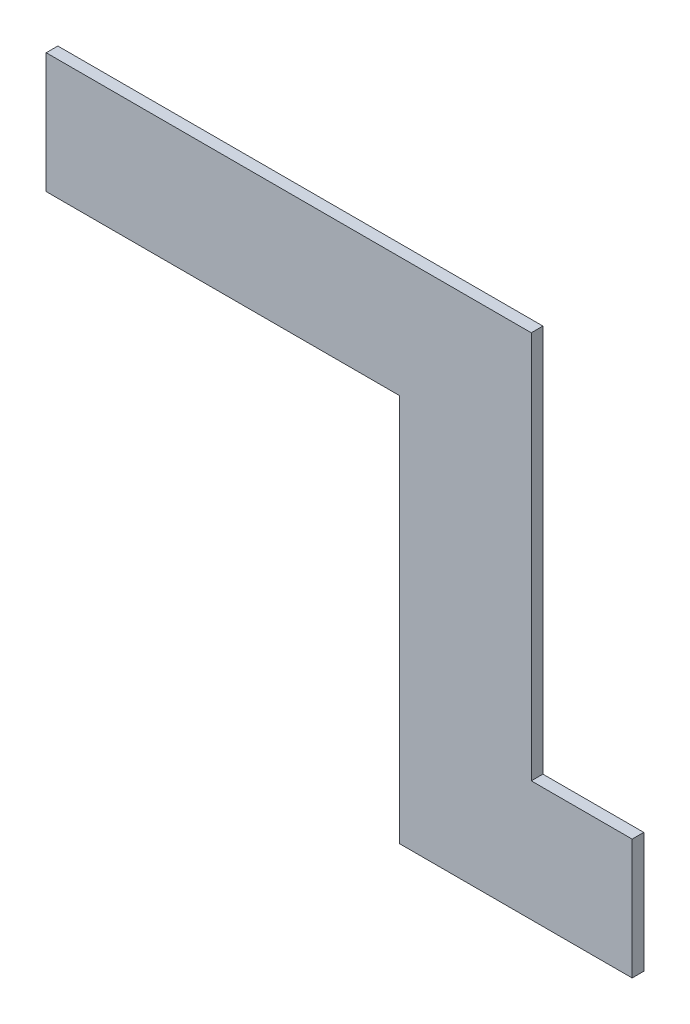
ISO-10303-21;
HEADER;
FILE_DESCRIPTION(('STEP AP214'),'2;1');
FILE_NAME('part.step','',(''),(''),'','','');
FILE_SCHEMA(('AUTOMOTIVE_DESIGN { 1 0 10303 214 1 1 1 1 }'));
ENDSEC;
DATA;
#1=APPLICATION_CONTEXT('core data for automotive mechanical design processes');
#2=APPLICATION_PROTOCOL_DEFINITION('international standard','automotive_design',2000,#1);
#3=PRODUCT_CONTEXT('',#1,'mechanical');
#4=PRODUCT('Part','Part','',(#3));
#5=PRODUCT_RELATED_PRODUCT_CATEGORY('part','',(#4));
#6=PRODUCT_DEFINITION_FORMATION('','',#4);
#7=PRODUCT_DEFINITION_CONTEXT('part definition',#1,'design');
#8=PRODUCT_DEFINITION('design','',#6,#7);
#9=PRODUCT_DEFINITION_SHAPE('','',#8);
#10=(LENGTH_UNIT() NAMED_UNIT(*) SI_UNIT(.MILLI.,.METRE.));
#11=(NAMED_UNIT(*) PLANE_ANGLE_UNIT() SI_UNIT($,.RADIAN.));
#12=(NAMED_UNIT(*) SI_UNIT($,.STERADIAN.) SOLID_ANGLE_UNIT());
#13=UNCERTAINTY_MEASURE_WITH_UNIT(LENGTH_MEASURE(1.E-05),#10,'distance_accuracy_value','');
#14=(GEOMETRIC_REPRESENTATION_CONTEXT(3) GLOBAL_UNCERTAINTY_ASSIGNED_CONTEXT((#13)) GLOBAL_UNIT_ASSIGNED_CONTEXT((#10,
#11,#12)) REPRESENTATION_CONTEXT('',''));
#15=CARTESIAN_POINT('',(0.,0.,0.));
#16=DIRECTION('',(0.,0.,1.));
#17=DIRECTION('',(1.,0.,0.));
#18=AXIS2_PLACEMENT_3D('',#15,#16,#17);
#19=CARTESIAN_POINT('',(34.,81.,3.));
#20=DIRECTION('',(0.,-1.,0.));
#21=DIRECTION('',(1.,0.,0.));
#22=AXIS2_PLACEMENT_3D('',#19,#20,#21);
#23=PLANE('',#22);
#24=DIRECTION('',(-1.,0.,0.));
#25=VECTOR('',#24,1.);
#26=CARTESIAN_POINT('',(34.,81.,0.));
#27=LINE('',#26,#25);
#28=CARTESIAN_POINT('',(34.,81.,0.));
#29=VERTEX_POINT('',#28);
#30=CARTESIAN_POINT('',(-91.,81.,0.));
#31=VERTEX_POINT('',#30);
#32=EDGE_CURVE('E129',#29,#31,#27,.T.);
#33=ORIENTED_EDGE('',*,*,#32,.T.);
#34=DIRECTION('',(0.,0.,-1.));
#35=VECTOR('',#34,1.);
#36=CARTESIAN_POINT('',(-91.,81.,3.));
#37=LINE('',#36,#35);
#38=CARTESIAN_POINT('',(-91.,81.,3.));
#39=VERTEX_POINT('',#38);
#40=EDGE_CURVE('E11',#39,#31,#37,.T.);
#41=ORIENTED_EDGE('',*,*,#40,.F.);
#42=DIRECTION('',(-1.,0.,0.));
#43=VECTOR('',#42,1.);
#44=CARTESIAN_POINT('',(34.,81.,3.));
#45=LINE('',#44,#43);
#46=CARTESIAN_POINT('',(34.,81.,3.));
#47=VERTEX_POINT('',#46);
#48=EDGE_CURVE('E143',#47,#39,#45,.T.);
#49=ORIENTED_EDGE('',*,*,#48,.F.);
#50=DIRECTION('',(0.,0.,-1.));
#51=VECTOR('',#50,1.);
#52=CARTESIAN_POINT('',(34.,81.,3.));
#53=LINE('',#52,#51);
#54=EDGE_CURVE('E125',#47,#29,#53,.T.);
#55=ORIENTED_EDGE('',*,*,#54,.T.);
#56=EDGE_LOOP('',(#33,#41,#49,#55));
#57=FACE_BOUND('',#56,.T.);
#58=ADVANCED_FACE('F33',(#57),#23,.F.);
#59=CARTESIAN_POINT('',(-91.,81.,3.));
#60=DIRECTION('',(1.,0.,0.));
#61=DIRECTION('',(0.,0.,-1.));
#62=AXIS2_PLACEMENT_3D('',#59,#60,#61);
#63=PLANE('',#62);
#64=DIRECTION('',(0.,-1.,0.));
#65=VECTOR('',#64,1.);
#66=CARTESIAN_POINT('',(-91.,81.,0.));
#67=LINE('',#66,#65);
#68=CARTESIAN_POINT('',(-91.,50.,0.));
#69=VERTEX_POINT('',#68);
#70=EDGE_CURVE('E132',#31,#69,#67,.T.);
#71=ORIENTED_EDGE('',*,*,#70,.T.);
#72=DIRECTION('',(0.,0.,-1.));
#73=VECTOR('',#72,1.);
#74=CARTESIAN_POINT('',(-91.,50.,3.));
#75=LINE('',#74,#73);
#76=CARTESIAN_POINT('',(-91.,50.,3.));
#77=VERTEX_POINT('',#76);
#78=EDGE_CURVE('E41',#77,#69,#75,.T.);
#79=ORIENTED_EDGE('',*,*,#78,.F.);
#80=DIRECTION('',(0.,-1.,0.));
#81=VECTOR('',#80,1.);
#82=CARTESIAN_POINT('',(-91.,81.,3.));
#83=LINE('',#82,#81);
#84=EDGE_CURVE('E92',#39,#77,#83,.T.);
#85=ORIENTED_EDGE('',*,*,#84,.F.);
#86=ORIENTED_EDGE('',*,*,#40,.T.);
#87=EDGE_LOOP('',(#71,#79,#85,#86));
#88=FACE_BOUND('',#87,.T.);
#89=ADVANCED_FACE('F178',(#88),#63,.F.);
#90=CARTESIAN_POINT('',(-91.,50.,3.));
#91=DIRECTION('',(0.,1.,0.));
#92=DIRECTION('',(0.,0.,1.));
#93=AXIS2_PLACEMENT_3D('',#90,#91,#92);
#94=PLANE('',#93);
#95=DIRECTION('',(1.,0.,0.));
#96=VECTOR('',#95,1.);
#97=CARTESIAN_POINT('',(-91.,50.,0.));
#98=LINE('',#97,#96);
#99=CARTESIAN_POINT('',(0.,50.,0.));
#100=VERTEX_POINT('',#99);
#101=EDGE_CURVE('E134',#69,#100,#98,.T.);
#102=ORIENTED_EDGE('',*,*,#101,.T.);
#103=DIRECTION('',(0.,0.,-1.));
#104=VECTOR('',#103,1.);
#105=CARTESIAN_POINT('',(0.,50.,3.));
#106=LINE('',#105,#104);
#107=CARTESIAN_POINT('',(0.,50.,3.));
#108=VERTEX_POINT('',#107);
#109=EDGE_CURVE('E150',#108,#100,#106,.T.);
#110=ORIENTED_EDGE('',*,*,#109,.F.);
#111=DIRECTION('',(1.,0.,0.));
#112=VECTOR('',#111,1.);
#113=CARTESIAN_POINT('',(-91.,50.,3.));
#114=LINE('',#113,#112);
#115=EDGE_CURVE('E158',#77,#108,#114,.T.);
#116=ORIENTED_EDGE('',*,*,#115,.F.);
#117=ORIENTED_EDGE('',*,*,#78,.T.);
#118=EDGE_LOOP('',(#102,#110,#116,#117));
#119=FACE_BOUND('',#118,.T.);
#120=ADVANCED_FACE('F156',(#119),#94,.F.);
#121=CARTESIAN_POINT('',(0.,50.,3.));
#122=DIRECTION('',(1.,0.,0.));
#123=DIRECTION('',(0.,0.,-1.));
#124=AXIS2_PLACEMENT_3D('',#121,#122,#123);
#125=PLANE('',#124);
#126=DIRECTION('',(0.,-1.,0.));
#127=VECTOR('',#126,1.);
#128=CARTESIAN_POINT('',(0.,50.,0.));
#129=LINE('',#128,#127);
#130=CARTESIAN_POINT('',(0.,-50.,0.));
#131=VERTEX_POINT('',#130);
#132=EDGE_CURVE('E136',#100,#131,#129,.T.);
#133=ORIENTED_EDGE('',*,*,#132,.T.);
#134=DIRECTION('',(0.,0.,-1.));
#135=VECTOR('',#134,1.);
#136=CARTESIAN_POINT('',(0.,-50.,3.));
#137=LINE('',#136,#135);
#138=CARTESIAN_POINT('',(0.,-50.,3.));
#139=VERTEX_POINT('',#138);
#140=EDGE_CURVE('E147',#139,#131,#137,.T.);
#141=ORIENTED_EDGE('',*,*,#140,.F.);
#142=DIRECTION('',(0.,-1.,0.));
#143=VECTOR('',#142,1.);
#144=CARTESIAN_POINT('',(0.,50.,3.));
#145=LINE('',#144,#143);
#146=EDGE_CURVE('E170',#108,#139,#145,.T.);
#147=ORIENTED_EDGE('',*,*,#146,.F.);
#148=ORIENTED_EDGE('',*,*,#109,.T.);
#149=EDGE_LOOP('',(#133,#141,#147,#148));
#150=FACE_BOUND('',#149,.T.);
#151=ADVANCED_FACE('F166',(#150),#125,.F.);
#152=CARTESIAN_POINT('',(0.,-50.,3.));
#153=DIRECTION('',(0.,1.,0.));
#154=DIRECTION('',(-1.,0.,0.));
#155=AXIS2_PLACEMENT_3D('',#152,#153,#154);
#156=PLANE('',#155);
#157=DIRECTION('',(1.,0.,0.));
#158=VECTOR('',#157,1.);
#159=CARTESIAN_POINT('',(0.,-50.,0.));
#160=LINE('',#159,#158);
#161=CARTESIAN_POINT('',(60.,-50.,0.));
#162=VERTEX_POINT('',#161);
#163=EDGE_CURVE('E138',#131,#162,#160,.T.);
#164=ORIENTED_EDGE('',*,*,#163,.T.);
#165=DIRECTION('',(0.,0.,-1.));
#166=VECTOR('',#165,1.);
#167=CARTESIAN_POINT('',(60.,-50.,3.));
#168=LINE('',#167,#166);
#169=CARTESIAN_POINT('',(60.,-50.,3.));
#170=VERTEX_POINT('',#169);
#171=EDGE_CURVE('E120',#170,#162,#168,.T.);
#172=ORIENTED_EDGE('',*,*,#171,.F.);
#173=DIRECTION('',(1.,0.,0.));
#174=VECTOR('',#173,1.);
#175=CARTESIAN_POINT('',(0.,-50.,3.));
#176=LINE('',#175,#174);
#177=EDGE_CURVE('E111',#139,#170,#176,.T.);
#178=ORIENTED_EDGE('',*,*,#177,.F.);
#179=ORIENTED_EDGE('',*,*,#140,.T.);
#180=EDGE_LOOP('',(#164,#172,#178,#179));
#181=FACE_BOUND('',#180,.T.);
#182=ADVANCED_FACE('F169',(#181),#156,.F.);
#183=CARTESIAN_POINT('',(60.,-50.,3.));
#184=DIRECTION('',(-1.,0.,0.));
#185=DIRECTION('',(0.,-1.,0.));
#186=AXIS2_PLACEMENT_3D('',#183,#184,#185);
#187=PLANE('',#186);
#188=DIRECTION('',(0.,1.,0.));
#189=VECTOR('',#188,1.);
#190=CARTESIAN_POINT('',(60.,-50.,0.));
#191=LINE('',#190,#189);
#192=CARTESIAN_POINT('',(60.,-19.,0.));
#193=VERTEX_POINT('',#192);
#194=EDGE_CURVE('E119',#162,#193,#191,.T.);
#195=ORIENTED_EDGE('',*,*,#194,.T.);
#196=DIRECTION('',(0.,0.,-1.));
#197=VECTOR('',#196,1.);
#198=CARTESIAN_POINT('',(60.,-19.,3.));
#199=LINE('',#198,#197);
#200=CARTESIAN_POINT('',(60.,-19.,3.));
#201=VERTEX_POINT('',#200);
#202=EDGE_CURVE('E116',#201,#193,#199,.T.);
#203=ORIENTED_EDGE('',*,*,#202,.F.);
#204=DIRECTION('',(0.,1.,0.));
#205=VECTOR('',#204,1.);
#206=CARTESIAN_POINT('',(60.,-50.,3.));
#207=LINE('',#206,#205);
#208=EDGE_CURVE('E105',#170,#201,#207,.T.);
#209=ORIENTED_EDGE('',*,*,#208,.F.);
#210=ORIENTED_EDGE('',*,*,#171,.T.);
#211=EDGE_LOOP('',(#195,#203,#209,#210));
#212=FACE_BOUND('',#211,.T.);
#213=ADVANCED_FACE('F117',(#212),#187,.F.);
#214=CARTESIAN_POINT('',(60.,-19.,3.));
#215=DIRECTION('',(0.,-1.,0.));
#216=DIRECTION('',(1.,0.,0.));
#217=AXIS2_PLACEMENT_3D('',#214,#215,#216);
#218=PLANE('',#217);
#219=DIRECTION('',(-1.,0.,0.));
#220=VECTOR('',#219,1.);
#221=CARTESIAN_POINT('',(60.,-19.,0.));
#222=LINE('',#221,#220);
#223=CARTESIAN_POINT('',(34.,-19.,0.));
#224=VERTEX_POINT('',#223);
#225=EDGE_CURVE('E78',#193,#224,#222,.T.);
#226=ORIENTED_EDGE('',*,*,#225,.T.);
#227=DIRECTION('',(0.,0.,-1.));
#228=VECTOR('',#227,1.);
#229=CARTESIAN_POINT('',(34.,-19.,3.));
#230=LINE('',#229,#228);
#231=CARTESIAN_POINT('',(34.,-19.,3.));
#232=VERTEX_POINT('',#231);
#233=EDGE_CURVE('E121',#232,#224,#230,.T.);
#234=ORIENTED_EDGE('',*,*,#233,.F.);
#235=DIRECTION('',(-1.,0.,0.));
#236=VECTOR('',#235,1.);
#237=CARTESIAN_POINT('',(60.,-19.,3.));
#238=LINE('',#237,#236);
#239=EDGE_CURVE('E109',#201,#232,#238,.T.);
#240=ORIENTED_EDGE('',*,*,#239,.F.);
#241=ORIENTED_EDGE('',*,*,#202,.T.);
#242=EDGE_LOOP('',(#226,#234,#240,#241));
#243=FACE_BOUND('',#242,.T.);
#244=ADVANCED_FACE('F123',(#243),#218,.F.);
#245=CARTESIAN_POINT('',(34.,-19.,3.));
#246=DIRECTION('',(-1.,0.,0.));
#247=DIRECTION('',(0.,0.,1.));
#248=AXIS2_PLACEMENT_3D('',#245,#246,#247);
#249=PLANE('',#248);
#250=DIRECTION('',(0.,1.,0.));
#251=VECTOR('',#250,1.);
#252=CARTESIAN_POINT('',(34.,-19.,0.));
#253=LINE('',#252,#251);
#254=EDGE_CURVE('E84',#224,#29,#253,.T.);
#255=ORIENTED_EDGE('',*,*,#254,.T.);
#256=ORIENTED_EDGE('',*,*,#54,.F.);
#257=DIRECTION('',(0.,1.,0.));
#258=VECTOR('',#257,1.);
#259=CARTESIAN_POINT('',(34.,-19.,3.));
#260=LINE('',#259,#258);
#261=EDGE_CURVE('E49',#232,#47,#260,.T.);
#262=ORIENTED_EDGE('',*,*,#261,.F.);
#263=ORIENTED_EDGE('',*,*,#233,.T.);
#264=EDGE_LOOP('',(#255,#256,#262,#263));
#265=FACE_BOUND('',#264,.T.);
#266=ADVANCED_FACE('F194',(#265),#249,.F.);
#267=CARTESIAN_POINT('',(0.,0.,3.));
#268=DIRECTION('',(0.,0.,1.));
#269=DIRECTION('',(1.,0.,0.));
#270=AXIS2_PLACEMENT_3D('',#267,#268,#269);
#271=PLANE('',#270);
#272=ORIENTED_EDGE('',*,*,#48,.T.);
#273=ORIENTED_EDGE('',*,*,#84,.T.);
#274=ORIENTED_EDGE('',*,*,#115,.T.);
#275=ORIENTED_EDGE('',*,*,#146,.T.);
#276=ORIENTED_EDGE('',*,*,#177,.T.);
#277=ORIENTED_EDGE('',*,*,#208,.T.);
#278=ORIENTED_EDGE('',*,*,#239,.T.);
#279=ORIENTED_EDGE('',*,*,#261,.T.);
#280=EDGE_LOOP('',(#272,#273,#274,#275,#276,#277,#278,#279));
#281=FACE_BOUND('',#280,.T.);
#282=ADVANCED_FACE('F107',(#281),#271,.T.);
#283=CARTESIAN_POINT('',(0.,0.,0.));
#284=DIRECTION('',(0.,0.,1.));
#285=DIRECTION('',(1.,0.,0.));
#286=AXIS2_PLACEMENT_3D('',#283,#284,#285);
#287=PLANE('',#286);
#288=ORIENTED_EDGE('',*,*,#32,.F.);
#289=ORIENTED_EDGE('',*,*,#254,.F.);
#290=ORIENTED_EDGE('',*,*,#225,.F.);
#291=ORIENTED_EDGE('',*,*,#194,.F.);
#292=ORIENTED_EDGE('',*,*,#163,.F.);
#293=ORIENTED_EDGE('',*,*,#132,.F.);
#294=ORIENTED_EDGE('',*,*,#101,.F.);
#295=ORIENTED_EDGE('',*,*,#70,.F.);
#296=EDGE_LOOP('',(#288,#289,#290,#291,#292,#293,#294,#295));
#297=FACE_BOUND('',#296,.T.);
#298=ADVANCED_FACE('F162',(#297),#287,.F.);
#299=CLOSED_SHELL('',(#58,#89,#120,#151,#182,#213,#244,#266,#282,#298));
#300=MANIFOLD_SOLID_BREP('B2',#299);
#301=ADVANCED_BREP_SHAPE_REPRESENTATION('',(#18,#300),#14);
#302=SHAPE_DEFINITION_REPRESENTATION(#9,#301);
ENDSEC;
END-ISO-10303-21;
